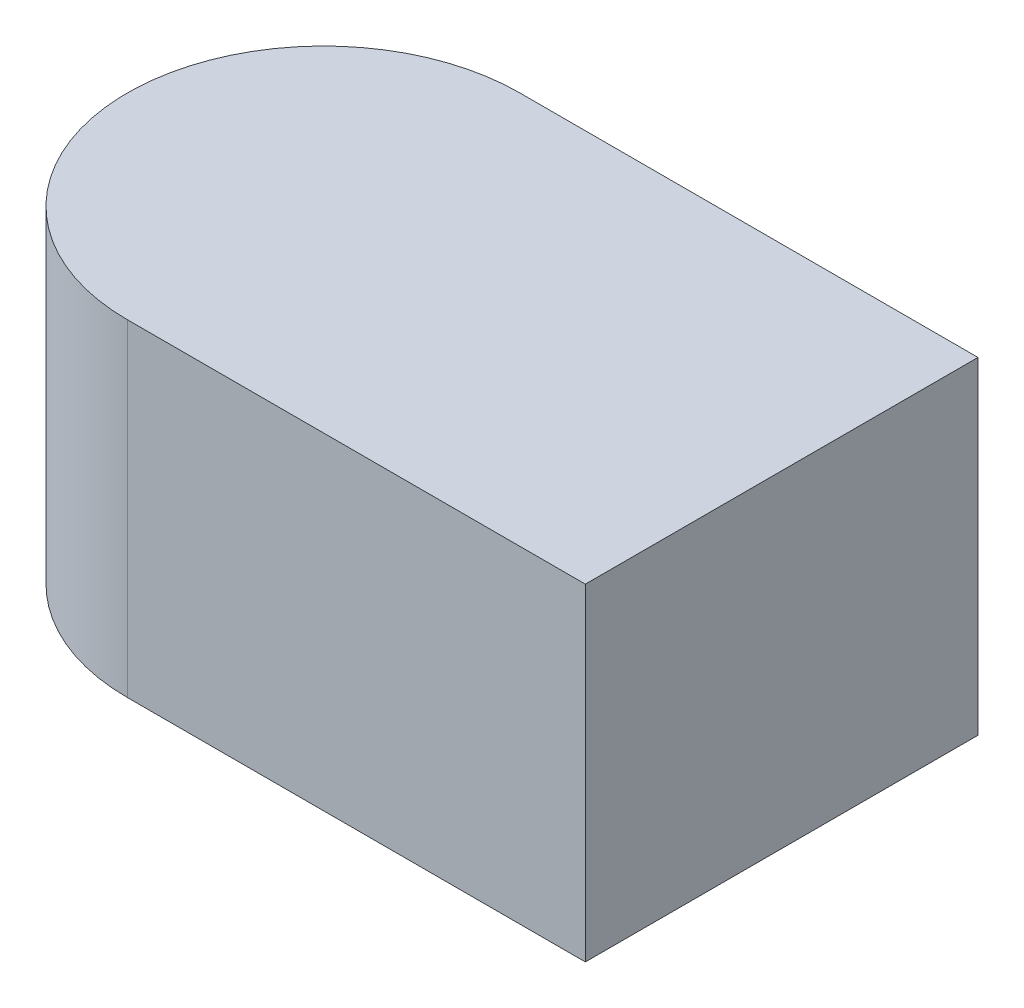
ISO-10303-21;
HEADER;
FILE_DESCRIPTION(('STEP AP214'),'2;1');
FILE_NAME('part.step','',(''),(''),'','','');
FILE_SCHEMA(('AUTOMOTIVE_DESIGN { 1 0 10303 214 1 1 1 1 }'));
ENDSEC;
DATA;
#1=APPLICATION_CONTEXT('core data for automotive mechanical design processes');
#2=APPLICATION_PROTOCOL_DEFINITION('international standard','automotive_design',2000,#1);
#3=PRODUCT_CONTEXT('',#1,'mechanical');
#4=PRODUCT('Part','Part','',(#3));
#5=PRODUCT_RELATED_PRODUCT_CATEGORY('part','',(#4));
#6=PRODUCT_DEFINITION_FORMATION('','',#4);
#7=PRODUCT_DEFINITION_CONTEXT('part definition',#1,'design');
#8=PRODUCT_DEFINITION('design','',#6,#7);
#9=PRODUCT_DEFINITION_SHAPE('','',#8);
#10=(LENGTH_UNIT() NAMED_UNIT(*) SI_UNIT(.MILLI.,.METRE.));
#11=(NAMED_UNIT(*) PLANE_ANGLE_UNIT() SI_UNIT($,.RADIAN.));
#12=(NAMED_UNIT(*) SI_UNIT($,.STERADIAN.) SOLID_ANGLE_UNIT());
#13=UNCERTAINTY_MEASURE_WITH_UNIT(LENGTH_MEASURE(1.E-05),#10,'distance_accuracy_value','');
#14=(GEOMETRIC_REPRESENTATION_CONTEXT(3) GLOBAL_UNCERTAINTY_ASSIGNED_CONTEXT((#13)) GLOBAL_UNIT_ASSIGNED_CONTEXT((#10,
#11,#12)) REPRESENTATION_CONTEXT('',''));
#15=CARTESIAN_POINT('',(0.,0.,0.));
#16=DIRECTION('',(0.,0.,1.));
#17=DIRECTION('',(1.,0.,0.));
#18=AXIS2_PLACEMENT_3D('',#15,#16,#17);
#19=CARTESIAN_POINT('',(0.,0.,0.));
#20=DIRECTION('',(0.,1.,0.));
#21=DIRECTION('',(1.,0.,0.));
#22=AXIS2_PLACEMENT_3D('',#19,#20,#21);
#23=PLANE('',#22);
#24=DIRECTION('',(0.,0.,-1.));
#25=VECTOR('',#24,1.);
#26=CARTESIAN_POINT('',(1.75,0.,0.37));
#27=LINE('',#26,#25);
#28=CARTESIAN_POINT('',(1.75,0.,0.37));
#29=VERTEX_POINT('',#28);
#30=CARTESIAN_POINT('',(1.75,0.,0.13));
#31=VERTEX_POINT('',#30);
#32=EDGE_CURVE('E11',#29,#31,#27,.T.);
#33=ORIENTED_EDGE('',*,*,#32,.F.);
#34=DIRECTION('',(1.,0.,0.));
#35=VECTOR('',#34,1.);
#36=CARTESIAN_POINT('',(1.47,0.,0.37));
#37=LINE('',#36,#35);
#38=CARTESIAN_POINT('',(1.47,0.,0.37));
#39=VERTEX_POINT('',#38);
#40=EDGE_CURVE('E24',#39,#29,#37,.T.);
#41=ORIENTED_EDGE('',*,*,#40,.F.);
#42=CARTESIAN_POINT('',(1.47,0.,0.25));
#43=DIRECTION('',(0.,1.,0.));
#44=DIRECTION('',(0.,0.,-1.));
#45=AXIS2_PLACEMENT_3D('',#42,#43,#44);
#46=CIRCLE('',#45,0.12);
#47=CARTESIAN_POINT('',(1.47,0.,0.13));
#48=VERTEX_POINT('',#47);
#49=EDGE_CURVE('E61',#48,#39,#46,.T.);
#50=ORIENTED_EDGE('',*,*,#49,.F.);
#51=DIRECTION('',(-1.,0.,0.));
#52=VECTOR('',#51,1.);
#53=CARTESIAN_POINT('',(1.75,0.,0.13));
#54=LINE('',#53,#52);
#55=EDGE_CURVE('E37',#31,#48,#54,.T.);
#56=ORIENTED_EDGE('',*,*,#55,.F.);
#57=EDGE_LOOP('',(#33,#41,#50,#56));
#58=FACE_BOUND('',#57,.T.);
#59=ADVANCED_FACE('F17',(#58),#23,.F.);
#60=CARTESIAN_POINT('',(1.75,0.,0.13));
#61=DIRECTION('',(0.,0.,-1.));
#62=DIRECTION('',(-1.,0.,0.));
#63=AXIS2_PLACEMENT_3D('',#60,#61,#62);
#64=PLANE('',#63);
#65=DIRECTION('',(0.,1.,0.));
#66=VECTOR('',#65,1.);
#67=CARTESIAN_POINT('',(1.47,0.,0.13));
#68=LINE('',#67,#66);
#69=CARTESIAN_POINT('',(1.47,0.2,0.13));
#70=VERTEX_POINT('',#69);
#71=EDGE_CURVE('E84',#48,#70,#68,.T.);
#72=ORIENTED_EDGE('',*,*,#71,.T.);
#73=DIRECTION('',(-1.,0.,0.));
#74=VECTOR('',#73,1.);
#75=CARTESIAN_POINT('',(1.75,0.2,0.13));
#76=LINE('',#75,#74);
#77=CARTESIAN_POINT('',(1.75,0.2,0.13));
#78=VERTEX_POINT('',#77);
#79=EDGE_CURVE('E74',#78,#70,#76,.T.);
#80=ORIENTED_EDGE('',*,*,#79,.F.);
#81=DIRECTION('',(0.,1.,0.));
#82=VECTOR('',#81,1.);
#83=CARTESIAN_POINT('',(1.75,0.,0.13));
#84=LINE('',#83,#82);
#85=EDGE_CURVE('E81',#31,#78,#84,.T.);
#86=ORIENTED_EDGE('',*,*,#85,.F.);
#87=ORIENTED_EDGE('',*,*,#55,.T.);
#88=EDGE_LOOP('',(#72,#80,#86,#87));
#89=FACE_BOUND('',#88,.T.);
#90=ADVANCED_FACE('F89',(#89),#64,.T.);
#91=CARTESIAN_POINT('',(1.75,0.,0.37));
#92=DIRECTION('',(1.,0.,0.));
#93=DIRECTION('',(0.,0.,-1.));
#94=AXIS2_PLACEMENT_3D('',#91,#92,#93);
#95=PLANE('',#94);
#96=ORIENTED_EDGE('',*,*,#85,.T.);
#97=DIRECTION('',(0.,0.,-1.));
#98=VECTOR('',#97,1.);
#99=CARTESIAN_POINT('',(1.75,0.2,0.37));
#100=LINE('',#99,#98);
#101=CARTESIAN_POINT('',(1.75,0.2,0.37));
#102=VERTEX_POINT('',#101);
#103=EDGE_CURVE('E79',#102,#78,#100,.T.);
#104=ORIENTED_EDGE('',*,*,#103,.F.);
#105=DIRECTION('',(0.,1.,0.));
#106=VECTOR('',#105,1.);
#107=CARTESIAN_POINT('',(1.75,0.,0.37));
#108=LINE('',#107,#106);
#109=EDGE_CURVE('E67',#29,#102,#108,.T.);
#110=ORIENTED_EDGE('',*,*,#109,.F.);
#111=ORIENTED_EDGE('',*,*,#32,.T.);
#112=EDGE_LOOP('',(#96,#104,#110,#111));
#113=FACE_BOUND('',#112,.T.);
#114=ADVANCED_FACE('F91',(#113),#95,.T.);
#115=CARTESIAN_POINT('',(1.47,0.,0.37));
#116=DIRECTION('',(0.,0.,1.));
#117=DIRECTION('',(1.,0.,0.));
#118=AXIS2_PLACEMENT_3D('',#115,#116,#117);
#119=PLANE('',#118);
#120=ORIENTED_EDGE('',*,*,#109,.T.);
#121=DIRECTION('',(1.,0.,0.));
#122=VECTOR('',#121,1.);
#123=CARTESIAN_POINT('',(1.47,0.2,0.37));
#124=LINE('',#123,#122);
#125=CARTESIAN_POINT('',(1.47,0.2,0.37));
#126=VERTEX_POINT('',#125);
#127=EDGE_CURVE('E62',#126,#102,#124,.T.);
#128=ORIENTED_EDGE('',*,*,#127,.F.);
#129=DIRECTION('',(0.,1.,0.));
#130=VECTOR('',#129,1.);
#131=CARTESIAN_POINT('',(1.47,0.,0.37));
#132=LINE('',#131,#130);
#133=EDGE_CURVE('E55',#39,#126,#132,.T.);
#134=ORIENTED_EDGE('',*,*,#133,.F.);
#135=ORIENTED_EDGE('',*,*,#40,.T.);
#136=EDGE_LOOP('',(#120,#128,#134,#135));
#137=FACE_BOUND('',#136,.T.);
#138=ADVANCED_FACE('F65',(#137),#119,.T.);
#139=CARTESIAN_POINT('',(1.47,0.,0.25));
#140=DIRECTION('',(0.,1.,0.));
#141=DIRECTION('',(1.,0.,0.));
#142=AXIS2_PLACEMENT_3D('',#139,#140,#141);
#143=CYLINDRICAL_SURFACE('',#142,0.12);
#144=ORIENTED_EDGE('',*,*,#133,.T.);
#145=CARTESIAN_POINT('',(1.47,0.2,0.25));
#146=DIRECTION('',(0.,1.,0.));
#147=DIRECTION('',(0.,0.,-1.));
#148=AXIS2_PLACEMENT_3D('',#145,#146,#147);
#149=CIRCLE('',#148,0.12);
#150=EDGE_CURVE('E60',#70,#126,#149,.T.);
#151=ORIENTED_EDGE('',*,*,#150,.F.);
#152=ORIENTED_EDGE('',*,*,#71,.F.);
#153=ORIENTED_EDGE('',*,*,#49,.T.);
#154=EDGE_LOOP('',(#144,#151,#152,#153));
#155=FACE_BOUND('',#154,.T.);
#156=ADVANCED_FACE('F57',(#155),#143,.T.);
#157=CARTESIAN_POINT('',(0.,0.2,0.));
#158=DIRECTION('',(0.,1.,0.));
#159=DIRECTION('',(1.,0.,0.));
#160=AXIS2_PLACEMENT_3D('',#157,#158,#159);
#161=PLANE('',#160);
#162=ORIENTED_EDGE('',*,*,#150,.T.);
#163=ORIENTED_EDGE('',*,*,#127,.T.);
#164=ORIENTED_EDGE('',*,*,#103,.T.);
#165=ORIENTED_EDGE('',*,*,#79,.T.);
#166=EDGE_LOOP('',(#162,#163,#164,#165));
#167=FACE_BOUND('',#166,.T.);
#168=ADVANCED_FACE('F72',(#167),#161,.T.);
#169=CLOSED_SHELL('',(#59,#90,#114,#138,#156,#168));
#170=MANIFOLD_SOLID_BREP('B1',#169);
#171=ADVANCED_BREP_SHAPE_REPRESENTATION('',(#18,#170),#14);
#172=SHAPE_DEFINITION_REPRESENTATION(#9,#171);
ENDSEC;
END-ISO-10303-21;
